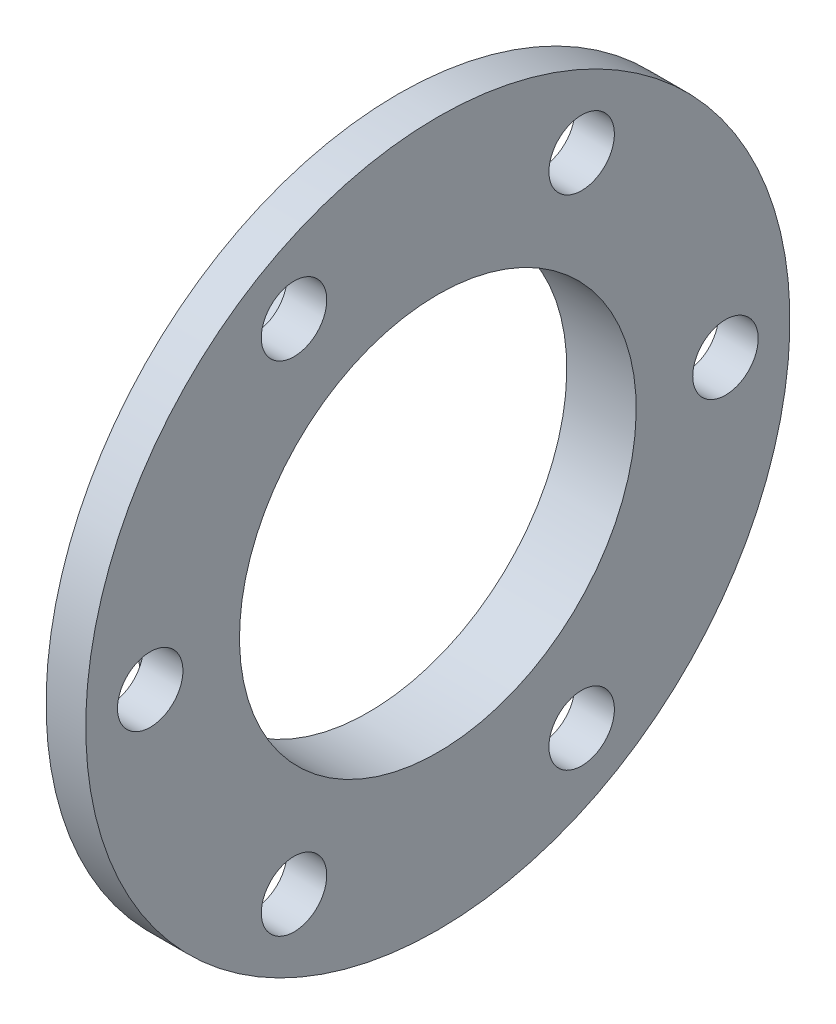
ISO-10303-21;
HEADER;
FILE_DESCRIPTION(('STEP AP214'),'2;1');
FILE_NAME('part.step','',(''),(''),'','','');
FILE_SCHEMA(('AUTOMOTIVE_DESIGN { 1 0 10303 214 1 1 1 1 }'));
ENDSEC;
DATA;
#1=APPLICATION_CONTEXT('core data for automotive mechanical design processes');
#2=APPLICATION_PROTOCOL_DEFINITION('international standard','automotive_design',2000,#1);
#3=PRODUCT_CONTEXT('',#1,'mechanical');
#4=PRODUCT('Part','Part','',(#3));
#5=PRODUCT_RELATED_PRODUCT_CATEGORY('part','',(#4));
#6=PRODUCT_DEFINITION_FORMATION('','',#4);
#7=PRODUCT_DEFINITION_CONTEXT('part definition',#1,'design');
#8=PRODUCT_DEFINITION('design','',#6,#7);
#9=PRODUCT_DEFINITION_SHAPE('','',#8);
#10=(LENGTH_UNIT() NAMED_UNIT(*) SI_UNIT(.MILLI.,.METRE.));
#11=(NAMED_UNIT(*) PLANE_ANGLE_UNIT() SI_UNIT($,.RADIAN.));
#12=(NAMED_UNIT(*) SI_UNIT($,.STERADIAN.) SOLID_ANGLE_UNIT());
#13=UNCERTAINTY_MEASURE_WITH_UNIT(LENGTH_MEASURE(1.E-05),#10,'distance_accuracy_value','');
#14=(GEOMETRIC_REPRESENTATION_CONTEXT(3) GLOBAL_UNCERTAINTY_ASSIGNED_CONTEXT((#13)) GLOBAL_UNIT_ASSIGNED_CONTEXT((#10,
#11,#12)) REPRESENTATION_CONTEXT('',''));
#15=CARTESIAN_POINT('',(0.,0.,0.));
#16=DIRECTION('',(0.,0.,1.));
#17=DIRECTION('',(1.,0.,0.));
#18=AXIS2_PLACEMENT_3D('',#15,#16,#17);
#19=CARTESIAN_POINT('',(-4.,0.,0.));
#20=DIRECTION('',(1.,0.,0.));
#21=DIRECTION('',(0.,1.,0.));
#22=AXIS2_PLACEMENT_3D('',#19,#20,#21);
#23=PLANE('',#22);
#24=CARTESIAN_POINT('',(-4.,0.,-29.));
#25=DIRECTION('',(-1.,0.,0.));
#26=DIRECTION('',(0.,0.,1.));
#27=AXIS2_PLACEMENT_3D('',#24,#25,#26);
#28=CIRCLE('',#27,3.29999999999999);
#29=CARTESIAN_POINT('',(-4.,0.,-25.7));
#30=VERTEX_POINT('',#29);
#31=EDGE_CURVE('E61',#30,#30,#28,.T.);
#32=ORIENTED_EDGE('',*,*,#31,.F.);
#33=EDGE_LOOP('',(#32));
#34=FACE_BOUND('',#33,.T.);
#35=CARTESIAN_POINT('',(-4.,0.,0.));
#36=DIRECTION('',(1.,0.,0.));
#37=DIRECTION('',(0.,1.,0.));
#38=AXIS2_PLACEMENT_3D('',#35,#36,#37);
#39=CIRCLE('',#38,35.5);
#40=CARTESIAN_POINT('',(-4.,35.5,0.));
#41=VERTEX_POINT('',#40);
#42=EDGE_CURVE('E47',#41,#41,#39,.T.);
#43=ORIENTED_EDGE('',*,*,#42,.F.);
#44=EDGE_LOOP('',(#43));
#45=FACE_BOUND('',#44,.T.);
#46=CARTESIAN_POINT('',(-4.,0.,0.));
#47=DIRECTION('',(1.,0.,0.));
#48=DIRECTION('',(0.,1.,0.));
#49=AXIS2_PLACEMENT_3D('',#46,#47,#48);
#50=CIRCLE('',#49,23.5);
#51=CARTESIAN_POINT('',(-4.,23.5,0.));
#52=VERTEX_POINT('',#51);
#53=EDGE_CURVE('E52',#52,#52,#50,.T.);
#54=ORIENTED_EDGE('',*,*,#53,.T.);
#55=EDGE_LOOP('',(#54));
#56=FACE_BOUND('',#55,.T.);
#57=CARTESIAN_POINT('',(-4.,25.1147367097488,-14.4999999999999));
#58=DIRECTION('',(-1.,0.,0.));
#59=DIRECTION('',(0.,0.,1.));
#60=AXIS2_PLACEMENT_3D('',#57,#58,#59);
#61=CIRCLE('',#60,3.29999999999999);
#62=CARTESIAN_POINT('',(-4.,25.1147367097488,-11.2));
#63=VERTEX_POINT('',#62);
#64=EDGE_CURVE('E67',#63,#63,#61,.T.);
#65=ORIENTED_EDGE('',*,*,#64,.F.);
#66=EDGE_LOOP('',(#65));
#67=FACE_BOUND('',#66,.T.);
#68=CARTESIAN_POINT('',(-4.,25.1147367097487,14.5000000000001));
#69=DIRECTION('',(-1.,0.,0.));
#70=DIRECTION('',(0.,0.,1.));
#71=AXIS2_PLACEMENT_3D('',#68,#69,#70);
#72=CIRCLE('',#71,3.29999999999999);
#73=CARTESIAN_POINT('',(-4.,25.1147367097487,17.8000000000001));
#74=VERTEX_POINT('',#73);
#75=EDGE_CURVE('E73',#74,#74,#72,.T.);
#76=ORIENTED_EDGE('',*,*,#75,.F.);
#77=EDGE_LOOP('',(#76));
#78=FACE_BOUND('',#77,.T.);
#79=CARTESIAN_POINT('',(-4.,0.,29.));
#80=DIRECTION('',(-1.,0.,0.));
#81=DIRECTION('',(0.,0.,1.));
#82=AXIS2_PLACEMENT_3D('',#79,#80,#81);
#83=CIRCLE('',#82,3.29999999999999);
#84=CARTESIAN_POINT('',(-4.,0.,32.3));
#85=VERTEX_POINT('',#84);
#86=EDGE_CURVE('E79',#85,#85,#83,.T.);
#87=ORIENTED_EDGE('',*,*,#86,.F.);
#88=EDGE_LOOP('',(#87));
#89=FACE_BOUND('',#88,.T.);
#90=CARTESIAN_POINT('',(-3.99999999999999,-25.1147367097489,14.4999999999998));
#91=DIRECTION('',(-1.,0.,0.));
#92=DIRECTION('',(0.,0.,1.));
#93=AXIS2_PLACEMENT_3D('',#90,#91,#92);
#94=CIRCLE('',#93,3.29999999999999);
#95=CARTESIAN_POINT('',(-3.99999999999999,-25.1147367097489,17.7999999999998));
#96=VERTEX_POINT('',#95);
#97=EDGE_CURVE('E85',#96,#96,#94,.T.);
#98=ORIENTED_EDGE('',*,*,#97,.F.);
#99=EDGE_LOOP('',(#98));
#100=FACE_BOUND('',#99,.T.);
#101=CARTESIAN_POINT('',(-3.99999999999999,-25.1147367097486,-14.5000000000003));
#102=DIRECTION('',(-1.,0.,0.));
#103=DIRECTION('',(0.,0.,1.));
#104=AXIS2_PLACEMENT_3D('',#101,#102,#103);
#105=CIRCLE('',#104,3.29999999999999);
#106=CARTESIAN_POINT('',(-3.99999999999999,-25.1147367097486,-11.2000000000003));
#107=VERTEX_POINT('',#106);
#108=EDGE_CURVE('E91',#107,#107,#105,.T.);
#109=ORIENTED_EDGE('',*,*,#108,.F.);
#110=EDGE_LOOP('',(#109));
#111=FACE_BOUND('',#110,.T.);
#112=ADVANCED_FACE('F32',(#34,#45,#56,#67,#78,#89,#100,#111),#23,.F.);
#113=CARTESIAN_POINT('',(-7.,0.,0.));
#114=DIRECTION('',(1.,0.,0.));
#115=DIRECTION('',(0.,1.,0.));
#116=AXIS2_PLACEMENT_3D('',#113,#114,#115);
#117=PLANE('',#116);
#118=CARTESIAN_POINT('',(-7.,0.,0.));
#119=DIRECTION('',(1.,0.,0.));
#120=DIRECTION('',(0.,1.,0.));
#121=AXIS2_PLACEMENT_3D('',#118,#119,#120);
#122=CIRCLE('',#121,23.5);
#123=CARTESIAN_POINT('',(-7.,23.5,0.));
#124=VERTEX_POINT('',#123);
#125=EDGE_CURVE('E55',#124,#124,#122,.T.);
#126=ORIENTED_EDGE('',*,*,#125,.F.);
#127=EDGE_LOOP('',(#126));
#128=FACE_BOUND('',#127,.T.);
#129=CARTESIAN_POINT('',(-7.,0.,0.));
#130=DIRECTION('',(1.,0.,0.));
#131=DIRECTION('',(0.,1.,0.));
#132=AXIS2_PLACEMENT_3D('',#129,#130,#131);
#133=CIRCLE('',#132,20.);
#134=CARTESIAN_POINT('',(-7.,20.,0.));
#135=VERTEX_POINT('',#134);
#136=EDGE_CURVE('E10',#135,#135,#133,.T.);
#137=ORIENTED_EDGE('',*,*,#136,.T.);
#138=EDGE_LOOP('',(#137));
#139=FACE_BOUND('',#138,.T.);
#140=ADVANCED_FACE('F34',(#128,#139),#117,.F.);
#141=CARTESIAN_POINT('',(0.,0.,0.));
#142=DIRECTION('',(1.,0.,0.));
#143=DIRECTION('',(0.,1.,0.));
#144=AXIS2_PLACEMENT_3D('',#141,#142,#143);
#145=CYLINDRICAL_SURFACE('',#144,20.);
#146=CARTESIAN_POINT('',(0.,0.,0.));
#147=DIRECTION('',(1.,0.,0.));
#148=DIRECTION('',(0.,1.,0.));
#149=AXIS2_PLACEMENT_3D('',#146,#147,#148);
#150=CIRCLE('',#149,20.);
#151=CARTESIAN_POINT('',(0.,20.,0.));
#152=VERTEX_POINT('',#151);
#153=EDGE_CURVE('E39',#152,#152,#150,.T.);
#154=ORIENTED_EDGE('',*,*,#153,.T.);
#155=EDGE_LOOP('',(#154));
#156=FACE_BOUND('',#155,.T.);
#157=ORIENTED_EDGE('',*,*,#136,.F.);
#158=EDGE_LOOP('',(#157));
#159=FACE_BOUND('',#158,.T.);
#160=ADVANCED_FACE('F103',(#156,#159),#145,.F.);
#161=CARTESIAN_POINT('',(0.,0.,0.));
#162=DIRECTION('',(-1.,0.,0.));
#163=DIRECTION('',(0.,-1.,0.));
#164=AXIS2_PLACEMENT_3D('',#161,#162,#163);
#165=PLANE('',#164);
#166=CARTESIAN_POINT('',(0.,-25.1147367097486,-14.5000000000003));
#167=DIRECTION('',(-1.,0.,0.));
#168=DIRECTION('',(0.,-1.,0.));
#169=AXIS2_PLACEMENT_3D('',#166,#167,#168);
#170=CIRCLE('',#169,3.29999999999999);
#171=CARTESIAN_POINT('',(0.,-28.4147367097485,-14.5000000000003));
#172=VERTEX_POINT('',#171);
#173=EDGE_CURVE('E88',#172,#172,#170,.T.);
#174=ORIENTED_EDGE('',*,*,#173,.T.);
#175=EDGE_LOOP('',(#174));
#176=FACE_BOUND('',#175,.T.);
#177=CARTESIAN_POINT('',(0.,-25.1147367097489,14.4999999999998));
#178=DIRECTION('',(-1.,0.,0.));
#179=DIRECTION('',(0.,-1.,0.));
#180=AXIS2_PLACEMENT_3D('',#177,#178,#179);
#181=CIRCLE('',#180,3.29999999999999);
#182=CARTESIAN_POINT('',(0.,-28.4147367097488,14.4999999999998));
#183=VERTEX_POINT('',#182);
#184=EDGE_CURVE('E82',#183,#183,#181,.T.);
#185=ORIENTED_EDGE('',*,*,#184,.T.);
#186=EDGE_LOOP('',(#185));
#187=FACE_BOUND('',#186,.T.);
#188=CARTESIAN_POINT('',(0.,0.,29.));
#189=DIRECTION('',(-1.,0.,0.));
#190=DIRECTION('',(0.,-1.,0.));
#191=AXIS2_PLACEMENT_3D('',#188,#189,#190);
#192=CIRCLE('',#191,3.29999999999999);
#193=CARTESIAN_POINT('',(0.,-3.29999999999999,29.));
#194=VERTEX_POINT('',#193);
#195=EDGE_CURVE('E76',#194,#194,#192,.T.);
#196=ORIENTED_EDGE('',*,*,#195,.T.);
#197=EDGE_LOOP('',(#196));
#198=FACE_BOUND('',#197,.T.);
#199=CARTESIAN_POINT('',(0.,25.1147367097487,14.5000000000001));
#200=DIRECTION('',(-1.,0.,0.));
#201=DIRECTION('',(0.,-1.,0.));
#202=AXIS2_PLACEMENT_3D('',#199,#200,#201);
#203=CIRCLE('',#202,3.29999999999999);
#204=CARTESIAN_POINT('',(0.,21.8147367097487,14.5000000000001));
#205=VERTEX_POINT('',#204);
#206=EDGE_CURVE('E70',#205,#205,#203,.T.);
#207=ORIENTED_EDGE('',*,*,#206,.T.);
#208=EDGE_LOOP('',(#207));
#209=FACE_BOUND('',#208,.T.);
#210=CARTESIAN_POINT('',(0.,25.1147367097488,-14.4999999999999));
#211=DIRECTION('',(-1.,0.,0.));
#212=DIRECTION('',(0.,-1.,0.));
#213=AXIS2_PLACEMENT_3D('',#210,#211,#212);
#214=CIRCLE('',#213,3.29999999999999);
#215=CARTESIAN_POINT('',(0.,21.8147367097488,-14.4999999999999));
#216=VERTEX_POINT('',#215);
#217=EDGE_CURVE('E64',#216,#216,#214,.T.);
#218=ORIENTED_EDGE('',*,*,#217,.T.);
#219=EDGE_LOOP('',(#218));
#220=FACE_BOUND('',#219,.T.);
#221=CARTESIAN_POINT('',(0.,0.,-29.));
#222=DIRECTION('',(-1.,0.,0.));
#223=DIRECTION('',(0.,-1.,0.));
#224=AXIS2_PLACEMENT_3D('',#221,#222,#223);
#225=CIRCLE('',#224,3.29999999999999);
#226=CARTESIAN_POINT('',(0.,-3.29999999999999,-29.));
#227=VERTEX_POINT('',#226);
#228=EDGE_CURVE('E58',#227,#227,#225,.T.);
#229=ORIENTED_EDGE('',*,*,#228,.T.);
#230=EDGE_LOOP('',(#229));
#231=FACE_BOUND('',#230,.T.);
#232=ORIENTED_EDGE('',*,*,#153,.F.);
#233=EDGE_LOOP('',(#232));
#234=FACE_BOUND('',#233,.T.);
#235=CARTESIAN_POINT('',(0.,0.,0.));
#236=DIRECTION('',(1.,0.,0.));
#237=DIRECTION('',(0.,1.,0.));
#238=AXIS2_PLACEMENT_3D('',#235,#236,#237);
#239=CIRCLE('',#238,35.5);
#240=CARTESIAN_POINT('',(0.,35.5,0.));
#241=VERTEX_POINT('',#240);
#242=EDGE_CURVE('E43',#241,#241,#239,.T.);
#243=ORIENTED_EDGE('',*,*,#242,.T.);
#244=EDGE_LOOP('',(#243));
#245=FACE_BOUND('',#244,.T.);
#246=ADVANCED_FACE('F114',(#176,#187,#198,#209,#220,#231,#234,#245),#165,.F.);
#247=CARTESIAN_POINT('',(0.,0.,0.));
#248=DIRECTION('',(1.,0.,0.));
#249=DIRECTION('',(0.,1.,0.));
#250=AXIS2_PLACEMENT_3D('',#247,#248,#249);
#251=CYLINDRICAL_SURFACE('',#250,35.5);
#252=ORIENTED_EDGE('',*,*,#242,.F.);
#253=EDGE_LOOP('',(#252));
#254=FACE_BOUND('',#253,.T.);
#255=ORIENTED_EDGE('',*,*,#42,.T.);
#256=EDGE_LOOP('',(#255));
#257=FACE_BOUND('',#256,.T.);
#258=ADVANCED_FACE('F111',(#254,#257),#251,.T.);
#259=CARTESIAN_POINT('',(0.,0.,0.));
#260=DIRECTION('',(1.,0.,0.));
#261=DIRECTION('',(0.,1.,0.));
#262=AXIS2_PLACEMENT_3D('',#259,#260,#261);
#263=CYLINDRICAL_SURFACE('',#262,23.5);
#264=ORIENTED_EDGE('',*,*,#53,.F.);
#265=EDGE_LOOP('',(#264));
#266=FACE_BOUND('',#265,.T.);
#267=ORIENTED_EDGE('',*,*,#125,.T.);
#268=EDGE_LOOP('',(#267));
#269=FACE_BOUND('',#268,.T.);
#270=ADVANCED_FACE('F109',(#266,#269),#263,.T.);
#271=CARTESIAN_POINT('',(-4.,0.,-29.));
#272=DIRECTION('',(-1.,0.,0.));
#273=DIRECTION('',(0.,0.,1.));
#274=AXIS2_PLACEMENT_3D('',#271,#272,#273);
#275=CYLINDRICAL_SURFACE('',#274,3.29999999999999);
#276=ORIENTED_EDGE('',*,*,#228,.F.);
#277=EDGE_LOOP('',(#276));
#278=FACE_BOUND('',#277,.T.);
#279=ORIENTED_EDGE('',*,*,#31,.T.);
#280=EDGE_LOOP('',(#279));
#281=FACE_BOUND('',#280,.T.);
#282=ADVANCED_FACE('F139',(#278,#281),#275,.F.);
#283=CARTESIAN_POINT('',(-4.,25.1147367097488,-14.4999999999999));
#284=DIRECTION('',(-1.,0.,0.));
#285=DIRECTION('',(0.,0.,1.));
#286=AXIS2_PLACEMENT_3D('',#283,#284,#285);
#287=CYLINDRICAL_SURFACE('',#286,3.29999999999999);
#288=ORIENTED_EDGE('',*,*,#217,.F.);
#289=EDGE_LOOP('',(#288));
#290=FACE_BOUND('',#289,.T.);
#291=ORIENTED_EDGE('',*,*,#64,.T.);
#292=EDGE_LOOP('',(#291));
#293=FACE_BOUND('',#292,.T.);
#294=ADVANCED_FACE('F146',(#290,#293),#287,.F.);
#295=CARTESIAN_POINT('',(-4.,25.1147367097487,14.5000000000001));
#296=DIRECTION('',(-1.,0.,0.));
#297=DIRECTION('',(0.,0.,1.));
#298=AXIS2_PLACEMENT_3D('',#295,#296,#297);
#299=CYLINDRICAL_SURFACE('',#298,3.29999999999999);
#300=ORIENTED_EDGE('',*,*,#206,.F.);
#301=EDGE_LOOP('',(#300));
#302=FACE_BOUND('',#301,.T.);
#303=ORIENTED_EDGE('',*,*,#75,.T.);
#304=EDGE_LOOP('',(#303));
#305=FACE_BOUND('',#304,.T.);
#306=ADVANCED_FACE('F152',(#302,#305),#299,.F.);
#307=CARTESIAN_POINT('',(-4.,0.,29.));
#308=DIRECTION('',(-1.,0.,0.));
#309=DIRECTION('',(0.,0.,1.));
#310=AXIS2_PLACEMENT_3D('',#307,#308,#309);
#311=CYLINDRICAL_SURFACE('',#310,3.29999999999999);
#312=ORIENTED_EDGE('',*,*,#195,.F.);
#313=EDGE_LOOP('',(#312));
#314=FACE_BOUND('',#313,.T.);
#315=ORIENTED_EDGE('',*,*,#86,.T.);
#316=EDGE_LOOP('',(#315));
#317=FACE_BOUND('',#316,.T.);
#318=ADVANCED_FACE('F160',(#314,#317),#311,.F.);
#319=CARTESIAN_POINT('',(-3.99999999999999,-25.1147367097489,14.4999999999998));
#320=DIRECTION('',(-1.,0.,0.));
#321=DIRECTION('',(0.,0.,1.));
#322=AXIS2_PLACEMENT_3D('',#319,#320,#321);
#323=CYLINDRICAL_SURFACE('',#322,3.29999999999999);
#324=ORIENTED_EDGE('',*,*,#184,.F.);
#325=EDGE_LOOP('',(#324));
#326=FACE_BOUND('',#325,.T.);
#327=ORIENTED_EDGE('',*,*,#97,.T.);
#328=EDGE_LOOP('',(#327));
#329=FACE_BOUND('',#328,.T.);
#330=ADVANCED_FACE('F168',(#326,#329),#323,.F.);
#331=CARTESIAN_POINT('',(-3.99999999999999,-25.1147367097486,-14.5000000000003));
#332=DIRECTION('',(-1.,0.,0.));
#333=DIRECTION('',(0.,0.,1.));
#334=AXIS2_PLACEMENT_3D('',#331,#332,#333);
#335=CYLINDRICAL_SURFACE('',#334,3.29999999999999);
#336=ORIENTED_EDGE('',*,*,#173,.F.);
#337=EDGE_LOOP('',(#336));
#338=FACE_BOUND('',#337,.T.);
#339=ORIENTED_EDGE('',*,*,#108,.T.);
#340=EDGE_LOOP('',(#339));
#341=FACE_BOUND('',#340,.T.);
#342=ADVANCED_FACE('F95',(#338,#341),#335,.F.);
#343=CLOSED_SHELL('',(#112,#140,#160,#246,#258,#270,#282,#294,#306,#318,#330,#342));
#344=MANIFOLD_SOLID_BREP('B2',#343);
#345=ADVANCED_BREP_SHAPE_REPRESENTATION('',(#18,#344),#14);
#346=SHAPE_DEFINITION_REPRESENTATION(#9,#345);
ENDSEC;
END-ISO-10303-21;
